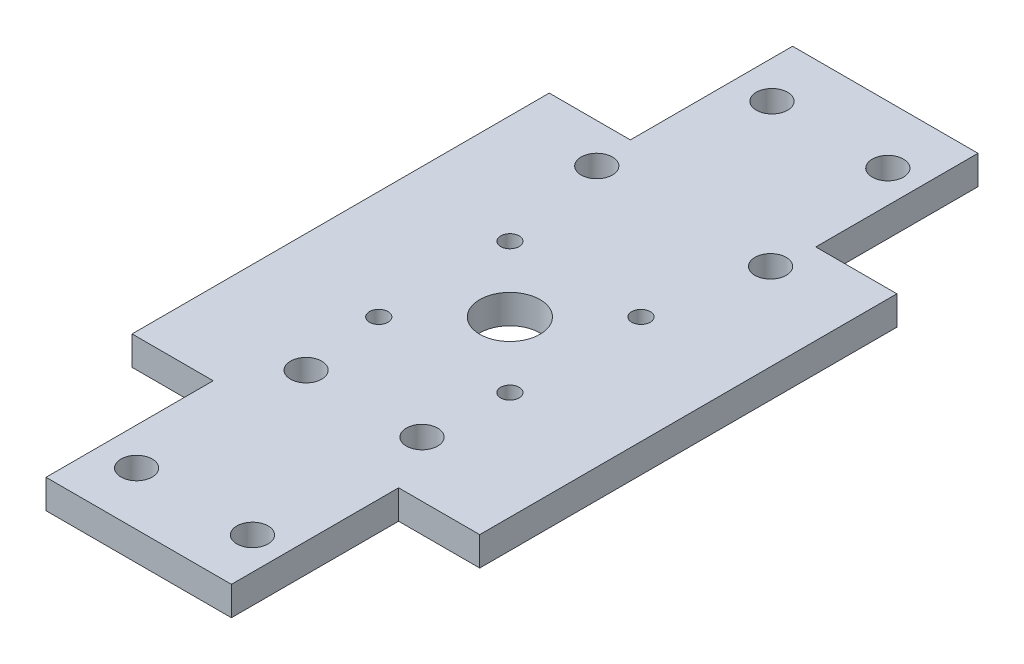
ISO-10303-21;
HEADER;
FILE_DESCRIPTION(('STEP AP214'),'2;1');
FILE_NAME('part.step','',(''),(''),'','','');
FILE_SCHEMA(('AUTOMOTIVE_DESIGN { 1 0 10303 214 1 1 1 1 }'));
ENDSEC;
DATA;
#1=APPLICATION_CONTEXT('core data for automotive mechanical design processes');
#2=APPLICATION_PROTOCOL_DEFINITION('international standard','automotive_design',2000,#1);
#3=PRODUCT_CONTEXT('',#1,'mechanical');
#4=PRODUCT('Part','Part','',(#3));
#5=PRODUCT_RELATED_PRODUCT_CATEGORY('part','',(#4));
#6=PRODUCT_DEFINITION_FORMATION('','',#4);
#7=PRODUCT_DEFINITION_CONTEXT('part definition',#1,'design');
#8=PRODUCT_DEFINITION('design','',#6,#7);
#9=PRODUCT_DEFINITION_SHAPE('','',#8);
#10=(LENGTH_UNIT() NAMED_UNIT(*) SI_UNIT(.MILLI.,.METRE.));
#11=(NAMED_UNIT(*) PLANE_ANGLE_UNIT() SI_UNIT($,.RADIAN.));
#12=(NAMED_UNIT(*) SI_UNIT($,.STERADIAN.) SOLID_ANGLE_UNIT());
#13=UNCERTAINTY_MEASURE_WITH_UNIT(LENGTH_MEASURE(1.E-05),#10,'distance_accuracy_value','');
#14=(GEOMETRIC_REPRESENTATION_CONTEXT(3) GLOBAL_UNCERTAINTY_ASSIGNED_CONTEXT((#13)) GLOBAL_UNIT_ASSIGNED_CONTEXT((#10,
#11,#12)) REPRESENTATION_CONTEXT('',''));
#15=CARTESIAN_POINT('',(0.,0.,0.));
#16=DIRECTION('',(0.,0.,1.));
#17=DIRECTION('',(1.,0.,0.));
#18=AXIS2_PLACEMENT_3D('',#15,#16,#17);
#19=CARTESIAN_POINT('',(-19.05,3.175,31.75));
#20=DIRECTION('',(0.,0.,-1.));
#21=DIRECTION('',(-1.,0.,0.));
#22=AXIS2_PLACEMENT_3D('',#19,#20,#21);
#23=PLANE('',#22);
#24=DIRECTION('',(0.,1.,0.));
#25=VECTOR('',#24,1.);
#26=CARTESIAN_POINT('',(10.16,0.,31.75));
#27=LINE('',#26,#25);
#28=CARTESIAN_POINT('',(10.16,0.,31.75));
#29=VERTEX_POINT('',#28);
#30=CARTESIAN_POINT('',(10.16,3.175,31.75));
#31=VERTEX_POINT('',#30);
#32=EDGE_CURVE('E305',#29,#31,#27,.T.);
#33=ORIENTED_EDGE('',*,*,#32,.F.);
#34=DIRECTION('',(1.,0.,0.));
#35=VECTOR('',#34,1.);
#36=CARTESIAN_POINT('',(-19.05,0.,31.75));
#37=LINE('',#36,#35);
#38=CARTESIAN_POINT('',(19.05,0.,31.75));
#39=VERTEX_POINT('',#38);
#40=EDGE_CURVE('E149',#29,#39,#37,.T.);
#41=ORIENTED_EDGE('',*,*,#40,.T.);
#42=DIRECTION('',(0.,-1.,0.));
#43=VECTOR('',#42,1.);
#44=CARTESIAN_POINT('',(19.05,3.175,31.75));
#45=LINE('',#44,#43);
#46=CARTESIAN_POINT('',(19.05,3.175,31.75));
#47=VERTEX_POINT('',#46);
#48=EDGE_CURVE('E42',#47,#39,#45,.T.);
#49=ORIENTED_EDGE('',*,*,#48,.F.);
#50=DIRECTION('',(1.,0.,0.));
#51=VECTOR('',#50,1.);
#52=CARTESIAN_POINT('',(-19.05,3.175,31.75));
#53=LINE('',#52,#51);
#54=EDGE_CURVE('E170',#31,#47,#53,.T.);
#55=ORIENTED_EDGE('',*,*,#54,.F.);
#56=EDGE_LOOP('',(#33,#41,#49,#55));
#57=FACE_BOUND('',#56,.T.);
#58=ADVANCED_FACE('F33',(#57),#23,.F.);
#59=CARTESIAN_POINT('',(19.05,3.175,31.75));
#60=DIRECTION('',(-1.,0.,0.));
#61=DIRECTION('',(0.,0.,1.));
#62=AXIS2_PLACEMENT_3D('',#59,#60,#61);
#63=PLANE('',#62);
#64=DIRECTION('',(0.,1.,0.));
#65=VECTOR('',#64,1.);
#66=CARTESIAN_POINT('',(19.05,0.,-13.97));
#67=LINE('',#66,#65);
#68=CARTESIAN_POINT('',(19.05,0.,-13.97));
#69=VERTEX_POINT('',#68);
#70=CARTESIAN_POINT('',(19.05,3.175,-13.97));
#71=VERTEX_POINT('',#70);
#72=EDGE_CURVE('E211',#69,#71,#67,.T.);
#73=ORIENTED_EDGE('',*,*,#72,.T.);
#74=DIRECTION('',(0.,0.,-1.));
#75=VECTOR('',#74,1.);
#76=CARTESIAN_POINT('',(19.05,3.175,31.75));
#77=LINE('',#76,#75);
#78=EDGE_CURVE('E148',#47,#71,#77,.T.);
#79=ORIENTED_EDGE('',*,*,#78,.F.);
#80=ORIENTED_EDGE('',*,*,#48,.T.);
#81=DIRECTION('',(0.,0.,-1.));
#82=VECTOR('',#81,1.);
#83=CARTESIAN_POINT('',(19.05,0.,31.75));
#84=LINE('',#83,#82);
#85=EDGE_CURVE('E180',#39,#69,#84,.T.);
#86=ORIENTED_EDGE('',*,*,#85,.T.);
#87=EDGE_LOOP('',(#73,#79,#80,#86));
#88=FACE_BOUND('',#87,.T.);
#89=ADVANCED_FACE('F35',(#88),#63,.F.);
#90=CARTESIAN_POINT('',(-19.05,3.175,-31.75));
#91=DIRECTION('',(0.,0.,1.));
#92=DIRECTION('',(1.,0.,0.));
#93=AXIS2_PLACEMENT_3D('',#90,#91,#92);
#94=PLANE('',#93);
#95=DIRECTION('',(0.,1.,0.));
#96=VECTOR('',#95,1.);
#97=CARTESIAN_POINT('',(10.16,0.,-31.75));
#98=LINE('',#97,#96);
#99=CARTESIAN_POINT('',(10.16,0.,-31.75));
#100=VERTEX_POINT('',#99);
#101=CARTESIAN_POINT('',(10.16,3.175,-31.75));
#102=VERTEX_POINT('',#101);
#103=EDGE_CURVE('E207',#100,#102,#98,.T.);
#104=ORIENTED_EDGE('',*,*,#103,.F.);
#105=DIRECTION('',(-1.,0.,0.));
#106=VECTOR('',#105,1.);
#107=CARTESIAN_POINT('',(-19.05,0.,-31.75));
#108=LINE('',#107,#106);
#109=CARTESIAN_POINT('',(-10.16,0.,-31.75));
#110=VERTEX_POINT('',#109);
#111=EDGE_CURVE('E182',#100,#110,#108,.T.);
#112=ORIENTED_EDGE('',*,*,#111,.T.);
#113=DIRECTION('',(0.,1.,0.));
#114=VECTOR('',#113,1.);
#115=CARTESIAN_POINT('',(-10.16,0.,-31.75));
#116=LINE('',#115,#114);
#117=CARTESIAN_POINT('',(-10.16,3.175,-31.75));
#118=VERTEX_POINT('',#117);
#119=EDGE_CURVE('E213',#110,#118,#116,.T.);
#120=ORIENTED_EDGE('',*,*,#119,.T.);
#121=DIRECTION('',(-1.,0.,0.));
#122=VECTOR('',#121,1.);
#123=CARTESIAN_POINT('',(-19.05,3.175,-31.75));
#124=LINE('',#123,#122);
#125=EDGE_CURVE('E152',#102,#118,#124,.T.);
#126=ORIENTED_EDGE('',*,*,#125,.F.);
#127=EDGE_LOOP('',(#104,#112,#120,#126));
#128=FACE_BOUND('',#127,.T.);
#129=ADVANCED_FACE('F292',(#128),#94,.F.);
#130=CARTESIAN_POINT('',(19.05,3.175,-31.75));
#131=DIRECTION('',(0.,-1.,0.));
#132=DIRECTION('',(0.,0.,-1.));
#133=AXIS2_PLACEMENT_3D('',#130,#131,#132);
#134=PLANE('',#133);
#135=CARTESIAN_POINT('',(0.0406851321502087,3.175,9.43357720583063));
#136=DIRECTION('',(0.,1.,0.));
#137=DIRECTION('',(0.,0.,1.));
#138=AXIS2_PLACEMENT_3D('',#135,#136,#137);
#139=CIRCLE('',#138,3.302);
#140=CARTESIAN_POINT('',(0.0406851321502087,3.175,12.7355772058306));
#141=VERTEX_POINT('',#140);
#142=EDGE_CURVE('E276',#141,#141,#139,.T.);
#143=ORIENTED_EDGE('',*,*,#142,.F.);
#144=EDGE_LOOP('',(#143));
#145=FACE_BOUND('',#144,.T.);
#146=CARTESIAN_POINT('',(7.22489002900553,3.175,16.617782102686));
#147=DIRECTION('',(0.,1.,0.));
#148=DIRECTION('',(0.,0.,1.));
#149=AXIS2_PLACEMENT_3D('',#146,#147,#148);
#150=CIRCLE('',#149,1.016);
#151=CARTESIAN_POINT('',(7.22489002900553,3.175,17.633782102686));
#152=VERTEX_POINT('',#151);
#153=EDGE_CURVE('E270',#152,#152,#150,.T.);
#154=ORIENTED_EDGE('',*,*,#153,.F.);
#155=EDGE_LOOP('',(#154));
#156=FACE_BOUND('',#155,.T.);
#157=CARTESIAN_POINT('',(-7.14351976470511,3.175,2.2493723089753));
#158=DIRECTION('',(0.,1.,0.));
#159=DIRECTION('',(0.,0.,1.));
#160=AXIS2_PLACEMENT_3D('',#157,#158,#159);
#161=CIRCLE('',#160,1.016);
#162=CARTESIAN_POINT('',(-7.14351976470511,3.175,3.2653723089753));
#163=VERTEX_POINT('',#162);
#164=EDGE_CURVE('E264',#163,#163,#161,.T.);
#165=ORIENTED_EDGE('',*,*,#164,.F.);
#166=EDGE_LOOP('',(#165));
#167=FACE_BOUND('',#166,.T.);
#168=CARTESIAN_POINT('',(-7.14351976470512,3.175,16.6177821026859));
#169=DIRECTION('',(0.,1.,0.));
#170=DIRECTION('',(0.,0.,1.));
#171=AXIS2_PLACEMENT_3D('',#168,#169,#170);
#172=CIRCLE('',#171,1.016);
#173=CARTESIAN_POINT('',(-7.14351976470512,3.175,17.6337821026859));
#174=VERTEX_POINT('',#173);
#175=EDGE_CURVE('E258',#174,#174,#172,.T.);
#176=ORIENTED_EDGE('',*,*,#175,.F.);
#177=EDGE_LOOP('',(#176));
#178=FACE_BOUND('',#177,.T.);
#179=CARTESIAN_POINT('',(7.22489002900554,3.175,2.2493723089753));
#180=DIRECTION('',(0.,1.,0.));
#181=DIRECTION('',(0.,0.,1.));
#182=AXIS2_PLACEMENT_3D('',#179,#180,#181);
#183=CIRCLE('',#182,1.016);
#184=CARTESIAN_POINT('',(7.22489002900554,3.175,3.2653723089753));
#185=VERTEX_POINT('',#184);
#186=EDGE_CURVE('E252',#185,#185,#183,.T.);
#187=ORIENTED_EDGE('',*,*,#186,.F.);
#188=EDGE_LOOP('',(#187));
#189=FACE_BOUND('',#188,.T.);
#190=CARTESIAN_POINT('',(-6.07182137832468,3.175,-25.4));
#191=DIRECTION('',(0.,1.,0.));
#192=DIRECTION('',(0.,0.,1.));
#193=AXIS2_PLACEMENT_3D('',#190,#191,#192);
#194=CIRCLE('',#193,1.7145);
#195=CARTESIAN_POINT('',(-6.07182137832468,3.175,-23.6855));
#196=VERTEX_POINT('',#195);
#197=EDGE_CURVE('E246',#196,#196,#194,.T.);
#198=ORIENTED_EDGE('',*,*,#197,.F.);
#199=EDGE_LOOP('',(#198));
#200=FACE_BOUND('',#199,.T.);
#201=CARTESIAN_POINT('',(6.62817862167532,3.175,-25.4));
#202=DIRECTION('',(0.,1.,0.));
#203=DIRECTION('',(0.,0.,1.));
#204=AXIS2_PLACEMENT_3D('',#201,#202,#203);
#205=CIRCLE('',#204,1.7145);
#206=CARTESIAN_POINT('',(6.62817862167532,3.175,-23.6855));
#207=VERTEX_POINT('',#206);
#208=EDGE_CURVE('E240',#207,#207,#205,.T.);
#209=ORIENTED_EDGE('',*,*,#208,.F.);
#210=EDGE_LOOP('',(#209));
#211=FACE_BOUND('',#210,.T.);
#212=CARTESIAN_POINT('',(6.62817862167533,3.175,25.654));
#213=DIRECTION('',(0.,1.,0.));
#214=DIRECTION('',(0.,0.,1.));
#215=AXIS2_PLACEMENT_3D('',#212,#213,#214);
#216=CIRCLE('',#215,1.7145);
#217=CARTESIAN_POINT('',(6.62817862167533,3.175,27.3685));
#218=VERTEX_POINT('',#217);
#219=EDGE_CURVE('E234',#218,#218,#216,.T.);
#220=ORIENTED_EDGE('',*,*,#219,.F.);
#221=EDGE_LOOP('',(#220));
#222=FACE_BOUND('',#221,.T.);
#223=CARTESIAN_POINT('',(-6.07182137832467,3.175,25.654));
#224=DIRECTION('',(0.,1.,0.));
#225=DIRECTION('',(0.,0.,1.));
#226=AXIS2_PLACEMENT_3D('',#223,#224,#225);
#227=CIRCLE('',#226,1.7145);
#228=CARTESIAN_POINT('',(-6.07182137832467,3.175,27.3685));
#229=VERTEX_POINT('',#228);
#230=EDGE_CURVE('E228',#229,#229,#227,.T.);
#231=ORIENTED_EDGE('',*,*,#230,.F.);
#232=EDGE_LOOP('',(#231));
#233=FACE_BOUND('',#232,.T.);
#234=CARTESIAN_POINT('',(9.525,3.175,-9.652));
#235=DIRECTION('',(0.,1.,0.));
#236=DIRECTION('',(0.,0.,1.));
#237=AXIS2_PLACEMENT_3D('',#234,#235,#236);
#238=CIRCLE('',#237,1.7145);
#239=CARTESIAN_POINT('',(9.525,3.175,-7.9375));
#240=VERTEX_POINT('',#239);
#241=EDGE_CURVE('E222',#240,#240,#238,.T.);
#242=ORIENTED_EDGE('',*,*,#241,.F.);
#243=EDGE_LOOP('',(#242));
#244=FACE_BOUND('',#243,.T.);
#245=CARTESIAN_POINT('',(-9.525,3.175,-9.652));
#246=DIRECTION('',(0.,1.,0.));
#247=DIRECTION('',(0.,0.,1.));
#248=AXIS2_PLACEMENT_3D('',#245,#246,#247);
#249=CIRCLE('',#248,1.7145);
#250=CARTESIAN_POINT('',(-9.525,3.175,-7.9375));
#251=VERTEX_POINT('',#250);
#252=EDGE_CURVE('E215',#251,#251,#249,.T.);
#253=ORIENTED_EDGE('',*,*,#252,.F.);
#254=EDGE_LOOP('',(#253));
#255=FACE_BOUND('',#254,.T.);
#256=DIRECTION('',(-1.,0.,0.));
#257=VECTOR('',#256,1.);
#258=CARTESIAN_POINT('',(10.16,3.175,-13.97));
#259=LINE('',#258,#257);
#260=CARTESIAN_POINT('',(10.16,3.175,-13.97));
#261=VERTEX_POINT('',#260);
#262=EDGE_CURVE('E296',#71,#261,#259,.T.);
#263=ORIENTED_EDGE('',*,*,#262,.T.);
#264=DIRECTION('',(0.,0.,-1.));
#265=VECTOR('',#264,1.);
#266=CARTESIAN_POINT('',(10.16,3.175,-31.75));
#267=LINE('',#266,#265);
#268=EDGE_CURVE('E299',#261,#102,#267,.T.);
#269=ORIENTED_EDGE('',*,*,#268,.T.);
#270=ORIENTED_EDGE('',*,*,#125,.T.);
#271=DIRECTION('',(0.,0.,-1.));
#272=VECTOR('',#271,1.);
#273=CARTESIAN_POINT('',(-10.16,3.175,-31.75));
#274=LINE('',#273,#272);
#275=CARTESIAN_POINT('',(-10.16,3.175,-13.97));
#276=VERTEX_POINT('',#275);
#277=EDGE_CURVE('E200',#276,#118,#274,.T.);
#278=ORIENTED_EDGE('',*,*,#277,.F.);
#279=DIRECTION('',(1.,0.,0.));
#280=VECTOR('',#279,1.);
#281=CARTESIAN_POINT('',(-10.16,3.175,-13.97));
#282=LINE('',#281,#280);
#283=CARTESIAN_POINT('',(-19.05,3.175,-13.97));
#284=VERTEX_POINT('',#283);
#285=EDGE_CURVE('E204',#284,#276,#282,.T.);
#286=ORIENTED_EDGE('',*,*,#285,.F.);
#287=DIRECTION('',(0.,0.,1.));
#288=VECTOR('',#287,1.);
#289=CARTESIAN_POINT('',(-19.05,3.175,31.75));
#290=LINE('',#289,#288);
#291=CARTESIAN_POINT('',(-19.05,3.175,31.75));
#292=VERTEX_POINT('',#291);
#293=EDGE_CURVE('E172',#284,#292,#290,.T.);
#294=ORIENTED_EDGE('',*,*,#293,.T.);
#295=CARTESIAN_POINT('',(-10.16,3.175,31.75));
#296=VERTEX_POINT('',#295);
#297=EDGE_CURVE('E164',#292,#296,#53,.T.);
#298=ORIENTED_EDGE('',*,*,#297,.T.);
#299=DIRECTION('',(0.,0.,1.));
#300=VECTOR('',#299,1.);
#301=CARTESIAN_POINT('',(-10.16,3.175,31.75));
#302=LINE('',#301,#300);
#303=CARTESIAN_POINT('',(-10.16,3.175,50.0735772058306));
#304=VERTEX_POINT('',#303);
#305=EDGE_CURVE('E50',#296,#304,#302,.T.);
#306=ORIENTED_EDGE('',*,*,#305,.T.);
#307=DIRECTION('',(1.,0.,0.));
#308=VECTOR('',#307,1.);
#309=CARTESIAN_POINT('',(-10.16,3.175,50.0735772058306));
#310=LINE('',#309,#308);
#311=CARTESIAN_POINT('',(10.16,3.175,50.0735772058306));
#312=VERTEX_POINT('',#311);
#313=EDGE_CURVE('E328',#304,#312,#310,.T.);
#314=ORIENTED_EDGE('',*,*,#313,.T.);
#315=DIRECTION('',(0.,0.,-1.));
#316=VECTOR('',#315,1.);
#317=CARTESIAN_POINT('',(10.16,3.175,50.0735772058306));
#318=LINE('',#317,#316);
#319=EDGE_CURVE('E144',#312,#31,#318,.T.);
#320=ORIENTED_EDGE('',*,*,#319,.T.);
#321=ORIENTED_EDGE('',*,*,#54,.T.);
#322=ORIENTED_EDGE('',*,*,#78,.T.);
#323=EDGE_LOOP('',(#263,#269,#270,#278,#286,#294,#298,#306,#314,#320,#321,#322));
#324=FACE_BOUND('',#323,.T.);
#325=CARTESIAN_POINT('',(6.62817862167533,3.175,44.2315772058306));
#326=DIRECTION('',(0.,1.,0.));
#327=DIRECTION('',(0.,0.,1.));
#328=AXIS2_PLACEMENT_3D('',#325,#326,#327);
#329=CIRCLE('',#328,1.7145);
#330=CARTESIAN_POINT('',(6.62817862167533,3.175,45.9460772058306));
#331=VERTEX_POINT('',#330);
#332=EDGE_CURVE('E346',#331,#331,#329,.T.);
#333=ORIENTED_EDGE('',*,*,#332,.F.);
#334=EDGE_LOOP('',(#333));
#335=FACE_BOUND('',#334,.T.);
#336=CARTESIAN_POINT('',(-6.07182137832467,3.175,44.2315772058306));
#337=DIRECTION('',(0.,1.,0.));
#338=DIRECTION('',(0.,0.,1.));
#339=AXIS2_PLACEMENT_3D('',#336,#337,#338);
#340=CIRCLE('',#339,1.7145);
#341=CARTESIAN_POINT('',(-6.07182137832467,3.175,45.9460772058306));
#342=VERTEX_POINT('',#341);
#343=EDGE_CURVE('E336',#342,#342,#340,.T.);
#344=ORIENTED_EDGE('',*,*,#343,.F.);
#345=EDGE_LOOP('',(#344));
#346=FACE_BOUND('',#345,.T.);
#347=ADVANCED_FACE('F287',(#145,#156,#167,#178,#189,#200,#211,#222,#233,#244,#255,#324,#335,
#346),#134,.F.);
#348=CARTESIAN_POINT('',(19.05,0.,-31.75));
#349=DIRECTION('',(0.,-1.,0.));
#350=DIRECTION('',(0.,0.,-1.));
#351=AXIS2_PLACEMENT_3D('',#348,#349,#350);
#352=PLANE('',#351);
#353=CARTESIAN_POINT('',(0.0406851321502087,0.,9.43357720583063));
#354=DIRECTION('',(0.,1.,0.));
#355=DIRECTION('',(0.,0.,1.));
#356=AXIS2_PLACEMENT_3D('',#353,#354,#355);
#357=CIRCLE('',#356,3.302);
#358=CARTESIAN_POINT('',(0.0406851321502087,0.,12.7355772058306));
#359=VERTEX_POINT('',#358);
#360=EDGE_CURVE('E183',#359,#359,#357,.T.);
#361=ORIENTED_EDGE('',*,*,#360,.T.);
#362=EDGE_LOOP('',(#361));
#363=FACE_BOUND('',#362,.T.);
#364=CARTESIAN_POINT('',(7.22489002900553,0.,16.617782102686));
#365=DIRECTION('',(0.,1.,0.));
#366=DIRECTION('',(0.,0.,1.));
#367=AXIS2_PLACEMENT_3D('',#364,#365,#366);
#368=CIRCLE('',#367,1.016);
#369=CARTESIAN_POINT('',(7.22489002900553,0.,17.633782102686));
#370=VERTEX_POINT('',#369);
#371=EDGE_CURVE('E273',#370,#370,#368,.T.);
#372=ORIENTED_EDGE('',*,*,#371,.T.);
#373=EDGE_LOOP('',(#372));
#374=FACE_BOUND('',#373,.T.);
#375=CARTESIAN_POINT('',(-7.14351976470511,0.,2.2493723089753));
#376=DIRECTION('',(0.,1.,0.));
#377=DIRECTION('',(0.,0.,1.));
#378=AXIS2_PLACEMENT_3D('',#375,#376,#377);
#379=CIRCLE('',#378,1.016);
#380=CARTESIAN_POINT('',(-7.14351976470511,0.,3.2653723089753));
#381=VERTEX_POINT('',#380);
#382=EDGE_CURVE('E267',#381,#381,#379,.T.);
#383=ORIENTED_EDGE('',*,*,#382,.T.);
#384=EDGE_LOOP('',(#383));
#385=FACE_BOUND('',#384,.T.);
#386=CARTESIAN_POINT('',(-7.14351976470512,0.,16.6177821026859));
#387=DIRECTION('',(0.,1.,0.));
#388=DIRECTION('',(0.,0.,1.));
#389=AXIS2_PLACEMENT_3D('',#386,#387,#388);
#390=CIRCLE('',#389,1.016);
#391=CARTESIAN_POINT('',(-7.14351976470512,0.,17.6337821026859));
#392=VERTEX_POINT('',#391);
#393=EDGE_CURVE('E261',#392,#392,#390,.T.);
#394=ORIENTED_EDGE('',*,*,#393,.T.);
#395=EDGE_LOOP('',(#394));
#396=FACE_BOUND('',#395,.T.);
#397=CARTESIAN_POINT('',(7.22489002900554,0.,2.2493723089753));
#398=DIRECTION('',(0.,1.,0.));
#399=DIRECTION('',(0.,0.,1.));
#400=AXIS2_PLACEMENT_3D('',#397,#398,#399);
#401=CIRCLE('',#400,1.016);
#402=CARTESIAN_POINT('',(7.22489002900554,0.,3.2653723089753));
#403=VERTEX_POINT('',#402);
#404=EDGE_CURVE('E255',#403,#403,#401,.T.);
#405=ORIENTED_EDGE('',*,*,#404,.T.);
#406=EDGE_LOOP('',(#405));
#407=FACE_BOUND('',#406,.T.);
#408=CARTESIAN_POINT('',(-6.07182137832468,0.,-25.4));
#409=DIRECTION('',(0.,1.,0.));
#410=DIRECTION('',(0.,0.,1.));
#411=AXIS2_PLACEMENT_3D('',#408,#409,#410);
#412=CIRCLE('',#411,1.7145);
#413=CARTESIAN_POINT('',(-6.07182137832468,0.,-23.6855));
#414=VERTEX_POINT('',#413);
#415=EDGE_CURVE('E249',#414,#414,#412,.T.);
#416=ORIENTED_EDGE('',*,*,#415,.T.);
#417=EDGE_LOOP('',(#416));
#418=FACE_BOUND('',#417,.T.);
#419=CARTESIAN_POINT('',(6.62817862167532,0.,-25.4));
#420=DIRECTION('',(0.,1.,0.));
#421=DIRECTION('',(0.,0.,1.));
#422=AXIS2_PLACEMENT_3D('',#419,#420,#421);
#423=CIRCLE('',#422,1.7145);
#424=CARTESIAN_POINT('',(6.62817862167532,0.,-23.6855));
#425=VERTEX_POINT('',#424);
#426=EDGE_CURVE('E243',#425,#425,#423,.T.);
#427=ORIENTED_EDGE('',*,*,#426,.T.);
#428=EDGE_LOOP('',(#427));
#429=FACE_BOUND('',#428,.T.);
#430=CARTESIAN_POINT('',(6.62817862167533,0.,25.654));
#431=DIRECTION('',(0.,1.,0.));
#432=DIRECTION('',(0.,0.,1.));
#433=AXIS2_PLACEMENT_3D('',#430,#431,#432);
#434=CIRCLE('',#433,1.7145);
#435=CARTESIAN_POINT('',(6.62817862167533,0.,27.3685));
#436=VERTEX_POINT('',#435);
#437=EDGE_CURVE('E237',#436,#436,#434,.T.);
#438=ORIENTED_EDGE('',*,*,#437,.T.);
#439=EDGE_LOOP('',(#438));
#440=FACE_BOUND('',#439,.T.);
#441=CARTESIAN_POINT('',(-6.07182137832467,0.,25.654));
#442=DIRECTION('',(0.,1.,0.));
#443=DIRECTION('',(0.,0.,1.));
#444=AXIS2_PLACEMENT_3D('',#441,#442,#443);
#445=CIRCLE('',#444,1.7145);
#446=CARTESIAN_POINT('',(-6.07182137832467,0.,27.3685));
#447=VERTEX_POINT('',#446);
#448=EDGE_CURVE('E231',#447,#447,#445,.T.);
#449=ORIENTED_EDGE('',*,*,#448,.T.);
#450=EDGE_LOOP('',(#449));
#451=FACE_BOUND('',#450,.T.);
#452=CARTESIAN_POINT('',(9.525,0.,-9.652));
#453=DIRECTION('',(0.,1.,0.));
#454=DIRECTION('',(0.,0.,1.));
#455=AXIS2_PLACEMENT_3D('',#452,#453,#454);
#456=CIRCLE('',#455,1.7145);
#457=CARTESIAN_POINT('',(9.525,0.,-7.9375));
#458=VERTEX_POINT('',#457);
#459=EDGE_CURVE('E225',#458,#458,#456,.T.);
#460=ORIENTED_EDGE('',*,*,#459,.T.);
#461=EDGE_LOOP('',(#460));
#462=FACE_BOUND('',#461,.T.);
#463=CARTESIAN_POINT('',(-9.525,0.,-9.652));
#464=DIRECTION('',(0.,1.,0.));
#465=DIRECTION('',(0.,0.,1.));
#466=AXIS2_PLACEMENT_3D('',#463,#464,#465);
#467=CIRCLE('',#466,1.7145);
#468=CARTESIAN_POINT('',(-9.525,0.,-7.9375));
#469=VERTEX_POINT('',#468);
#470=EDGE_CURVE('E219',#469,#469,#467,.T.);
#471=ORIENTED_EDGE('',*,*,#470,.T.);
#472=EDGE_LOOP('',(#471));
#473=FACE_BOUND('',#472,.T.);
#474=DIRECTION('',(0.,0.,-1.));
#475=VECTOR('',#474,1.);
#476=CARTESIAN_POINT('',(10.16,0.,-31.75));
#477=LINE('',#476,#475);
#478=CARTESIAN_POINT('',(10.16,0.,-13.97));
#479=VERTEX_POINT('',#478);
#480=EDGE_CURVE('E295',#479,#100,#477,.T.);
#481=ORIENTED_EDGE('',*,*,#480,.F.);
#482=DIRECTION('',(-1.,0.,0.));
#483=VECTOR('',#482,1.);
#484=CARTESIAN_POINT('',(10.16,0.,-13.97));
#485=LINE('',#484,#483);
#486=EDGE_CURVE('E293',#69,#479,#485,.T.);
#487=ORIENTED_EDGE('',*,*,#486,.F.);
#488=ORIENTED_EDGE('',*,*,#85,.F.);
#489=ORIENTED_EDGE('',*,*,#40,.F.);
#490=DIRECTION('',(0.,0.,-1.));
#491=VECTOR('',#490,1.);
#492=CARTESIAN_POINT('',(10.16,0.,50.0735772058306));
#493=LINE('',#492,#491);
#494=CARTESIAN_POINT('',(10.16,0.,50.0735772058306));
#495=VERTEX_POINT('',#494);
#496=EDGE_CURVE('E131',#495,#29,#493,.T.);
#497=ORIENTED_EDGE('',*,*,#496,.F.);
#498=DIRECTION('',(1.,0.,0.));
#499=VECTOR('',#498,1.);
#500=CARTESIAN_POINT('',(-10.16,0.,50.0735772058306));
#501=LINE('',#500,#499);
#502=CARTESIAN_POINT('',(-10.16,0.,50.0735772058306));
#503=VERTEX_POINT('',#502);
#504=EDGE_CURVE('E143',#503,#495,#501,.T.);
#505=ORIENTED_EDGE('',*,*,#504,.F.);
#506=DIRECTION('',(0.,0.,1.));
#507=VECTOR('',#506,1.);
#508=CARTESIAN_POINT('',(-10.16,0.,31.75));
#509=LINE('',#508,#507);
#510=CARTESIAN_POINT('',(-10.16,0.,31.75));
#511=VERTEX_POINT('',#510);
#512=EDGE_CURVE('E125',#511,#503,#509,.T.);
#513=ORIENTED_EDGE('',*,*,#512,.F.);
#514=CARTESIAN_POINT('',(-19.05,0.,31.75));
#515=VERTEX_POINT('',#514);
#516=EDGE_CURVE('E140',#515,#511,#37,.T.);
#517=ORIENTED_EDGE('',*,*,#516,.F.);
#518=DIRECTION('',(0.,0.,1.));
#519=VECTOR('',#518,1.);
#520=CARTESIAN_POINT('',(-19.05,0.,31.75));
#521=LINE('',#520,#519);
#522=CARTESIAN_POINT('',(-19.05,0.,-13.97));
#523=VERTEX_POINT('',#522);
#524=EDGE_CURVE('E154',#523,#515,#521,.T.);
#525=ORIENTED_EDGE('',*,*,#524,.F.);
#526=DIRECTION('',(1.,0.,0.));
#527=VECTOR('',#526,1.);
#528=CARTESIAN_POINT('',(-10.16,0.,-13.97));
#529=LINE('',#528,#527);
#530=CARTESIAN_POINT('',(-10.16,0.,-13.97));
#531=VERTEX_POINT('',#530);
#532=EDGE_CURVE('E196',#523,#531,#529,.T.);
#533=ORIENTED_EDGE('',*,*,#532,.T.);
#534=DIRECTION('',(0.,0.,-1.));
#535=VECTOR('',#534,1.);
#536=CARTESIAN_POINT('',(-10.16,0.,-31.75));
#537=LINE('',#536,#535);
#538=EDGE_CURVE('E197',#531,#110,#537,.T.);
#539=ORIENTED_EDGE('',*,*,#538,.T.);
#540=ORIENTED_EDGE('',*,*,#111,.F.);
#541=EDGE_LOOP('',(#481,#487,#488,#489,#497,#505,#513,#517,#525,#533,#539,#540));
#542=FACE_BOUND('',#541,.T.);
#543=CARTESIAN_POINT('',(6.62817862167533,0.,44.2315772058306));
#544=DIRECTION('',(0.,1.,0.));
#545=DIRECTION('',(0.,0.,1.));
#546=AXIS2_PLACEMENT_3D('',#543,#544,#545);
#547=CIRCLE('',#546,1.7145);
#548=CARTESIAN_POINT('',(6.62817862167533,0.,45.9460772058306));
#549=VERTEX_POINT('',#548);
#550=EDGE_CURVE('E343',#549,#549,#547,.T.);
#551=ORIENTED_EDGE('',*,*,#550,.T.);
#552=EDGE_LOOP('',(#551));
#553=FACE_BOUND('',#552,.T.);
#554=CARTESIAN_POINT('',(-6.07182137832467,0.,44.2315772058306));
#555=DIRECTION('',(0.,1.,0.));
#556=DIRECTION('',(0.,0.,1.));
#557=AXIS2_PLACEMENT_3D('',#554,#555,#556);
#558=CIRCLE('',#557,1.7145);
#559=CARTESIAN_POINT('',(-6.07182137832467,0.,45.9460772058306));
#560=VERTEX_POINT('',#559);
#561=EDGE_CURVE('E334',#560,#560,#558,.T.);
#562=ORIENTED_EDGE('',*,*,#561,.T.);
#563=EDGE_LOOP('',(#562));
#564=FACE_BOUND('',#563,.T.);
#565=ADVANCED_FACE('F137',(#363,#374,#385,#396,#407,#418,#429,#440,#451,#462,#473,#542,#553,
#564),#352,.T.);
#566=CARTESIAN_POINT('',(-19.05,3.175,31.75));
#567=DIRECTION('',(1.,0.,0.));
#568=DIRECTION('',(0.,0.,-1.));
#569=AXIS2_PLACEMENT_3D('',#566,#567,#568);
#570=PLANE('',#569);
#571=ORIENTED_EDGE('',*,*,#293,.F.);
#572=DIRECTION('',(0.,1.,0.));
#573=VECTOR('',#572,1.);
#574=CARTESIAN_POINT('',(-19.05,0.,-13.97));
#575=LINE('',#574,#573);
#576=EDGE_CURVE('E193',#523,#284,#575,.T.);
#577=ORIENTED_EDGE('',*,*,#576,.F.);
#578=ORIENTED_EDGE('',*,*,#524,.T.);
#579=DIRECTION('',(0.,-1.,0.));
#580=VECTOR('',#579,1.);
#581=CARTESIAN_POINT('',(-19.05,3.175,31.75));
#582=LINE('',#581,#580);
#583=EDGE_CURVE('E11',#292,#515,#582,.T.);
#584=ORIENTED_EDGE('',*,*,#583,.F.);
#585=EDGE_LOOP('',(#571,#577,#578,#584));
#586=FACE_BOUND('',#585,.T.);
#587=ADVANCED_FACE('F192',(#586),#570,.F.);
#588=ORIENTED_EDGE('',*,*,#516,.T.);
#589=DIRECTION('',(0.,1.,0.));
#590=VECTOR('',#589,1.);
#591=CARTESIAN_POINT('',(-10.16,0.,31.75));
#592=LINE('',#591,#590);
#593=EDGE_CURVE('E122',#511,#296,#592,.T.);
#594=ORIENTED_EDGE('',*,*,#593,.T.);
#595=ORIENTED_EDGE('',*,*,#297,.F.);
#596=ORIENTED_EDGE('',*,*,#583,.T.);
#597=EDGE_LOOP('',(#588,#594,#595,#596));
#598=FACE_BOUND('',#597,.T.);
#599=ADVANCED_FACE('F146',(#598),#23,.F.);
#600=CARTESIAN_POINT('',(0.0406851321502087,0.,9.43357720583063));
#601=DIRECTION('',(0.,1.,0.));
#602=DIRECTION('',(0.,0.,1.));
#603=AXIS2_PLACEMENT_3D('',#600,#601,#602);
#604=CYLINDRICAL_SURFACE('',#603,3.302);
#605=ORIENTED_EDGE('',*,*,#360,.F.);
#606=EDGE_LOOP('',(#605));
#607=FACE_BOUND('',#606,.T.);
#608=ORIENTED_EDGE('',*,*,#142,.T.);
#609=EDGE_LOOP('',(#608));
#610=FACE_BOUND('',#609,.T.);
#611=ADVANCED_FACE('F369',(#607,#610),#604,.F.);
#612=CARTESIAN_POINT('',(7.22489002900553,0.,16.617782102686));
#613=DIRECTION('',(0.,1.,0.));
#614=DIRECTION('',(0.,0.,1.));
#615=AXIS2_PLACEMENT_3D('',#612,#613,#614);
#616=CYLINDRICAL_SURFACE('',#615,1.016);
#617=ORIENTED_EDGE('',*,*,#371,.F.);
#618=EDGE_LOOP('',(#617));
#619=FACE_BOUND('',#618,.T.);
#620=ORIENTED_EDGE('',*,*,#153,.T.);
#621=EDGE_LOOP('',(#620));
#622=FACE_BOUND('',#621,.T.);
#623=ADVANCED_FACE('F374',(#619,#622),#616,.F.);
#624=CARTESIAN_POINT('',(-7.14351976470511,0.,2.2493723089753));
#625=DIRECTION('',(0.,1.,0.));
#626=DIRECTION('',(0.,0.,1.));
#627=AXIS2_PLACEMENT_3D('',#624,#625,#626);
#628=CYLINDRICAL_SURFACE('',#627,1.016);
#629=ORIENTED_EDGE('',*,*,#382,.F.);
#630=EDGE_LOOP('',(#629));
#631=FACE_BOUND('',#630,.T.);
#632=ORIENTED_EDGE('',*,*,#164,.T.);
#633=EDGE_LOOP('',(#632));
#634=FACE_BOUND('',#633,.T.);
#635=ADVANCED_FACE('F397',(#631,#634),#628,.F.);
#636=CARTESIAN_POINT('',(-7.14351976470512,0.,16.6177821026859));
#637=DIRECTION('',(0.,1.,0.));
#638=DIRECTION('',(0.,0.,1.));
#639=AXIS2_PLACEMENT_3D('',#636,#637,#638);
#640=CYLINDRICAL_SURFACE('',#639,1.016);
#641=ORIENTED_EDGE('',*,*,#393,.F.);
#642=EDGE_LOOP('',(#641));
#643=FACE_BOUND('',#642,.T.);
#644=ORIENTED_EDGE('',*,*,#175,.T.);
#645=EDGE_LOOP('',(#644));
#646=FACE_BOUND('',#645,.T.);
#647=ADVANCED_FACE('F401',(#643,#646),#640,.F.);
#648=CARTESIAN_POINT('',(7.22489002900554,0.,2.2493723089753));
#649=DIRECTION('',(0.,1.,0.));
#650=DIRECTION('',(0.,0.,1.));
#651=AXIS2_PLACEMENT_3D('',#648,#649,#650);
#652=CYLINDRICAL_SURFACE('',#651,1.016);
#653=ORIENTED_EDGE('',*,*,#404,.F.);
#654=EDGE_LOOP('',(#653));
#655=FACE_BOUND('',#654,.T.);
#656=ORIENTED_EDGE('',*,*,#186,.T.);
#657=EDGE_LOOP('',(#656));
#658=FACE_BOUND('',#657,.T.);
#659=ADVANCED_FACE('F405',(#655,#658),#652,.F.);
#660=CARTESIAN_POINT('',(-6.07182137832468,0.,-25.4));
#661=DIRECTION('',(0.,1.,0.));
#662=DIRECTION('',(0.,0.,1.));
#663=AXIS2_PLACEMENT_3D('',#660,#661,#662);
#664=CYLINDRICAL_SURFACE('',#663,1.7145);
#665=ORIENTED_EDGE('',*,*,#415,.F.);
#666=EDGE_LOOP('',(#665));
#667=FACE_BOUND('',#666,.T.);
#668=ORIENTED_EDGE('',*,*,#197,.T.);
#669=EDGE_LOOP('',(#668));
#670=FACE_BOUND('',#669,.T.);
#671=ADVANCED_FACE('F409',(#667,#670),#664,.F.);
#672=CARTESIAN_POINT('',(6.62817862167532,0.,-25.4));
#673=DIRECTION('',(0.,1.,0.));
#674=DIRECTION('',(0.,0.,1.));
#675=AXIS2_PLACEMENT_3D('',#672,#673,#674);
#676=CYLINDRICAL_SURFACE('',#675,1.7145);
#677=ORIENTED_EDGE('',*,*,#426,.F.);
#678=EDGE_LOOP('',(#677));
#679=FACE_BOUND('',#678,.T.);
#680=ORIENTED_EDGE('',*,*,#208,.T.);
#681=EDGE_LOOP('',(#680));
#682=FACE_BOUND('',#681,.T.);
#683=ADVANCED_FACE('F413',(#679,#682),#676,.F.);
#684=CARTESIAN_POINT('',(6.62817862167533,0.,25.654));
#685=DIRECTION('',(0.,1.,0.));
#686=DIRECTION('',(0.,0.,1.));
#687=AXIS2_PLACEMENT_3D('',#684,#685,#686);
#688=CYLINDRICAL_SURFACE('',#687,1.7145);
#689=ORIENTED_EDGE('',*,*,#437,.F.);
#690=EDGE_LOOP('',(#689));
#691=FACE_BOUND('',#690,.T.);
#692=ORIENTED_EDGE('',*,*,#219,.T.);
#693=EDGE_LOOP('',(#692));
#694=FACE_BOUND('',#693,.T.);
#695=ADVANCED_FACE('F417',(#691,#694),#688,.F.);
#696=CARTESIAN_POINT('',(-6.07182137832467,0.,25.654));
#697=DIRECTION('',(0.,1.,0.));
#698=DIRECTION('',(0.,0.,1.));
#699=AXIS2_PLACEMENT_3D('',#696,#697,#698);
#700=CYLINDRICAL_SURFACE('',#699,1.7145);
#701=ORIENTED_EDGE('',*,*,#448,.F.);
#702=EDGE_LOOP('',(#701));
#703=FACE_BOUND('',#702,.T.);
#704=ORIENTED_EDGE('',*,*,#230,.T.);
#705=EDGE_LOOP('',(#704));
#706=FACE_BOUND('',#705,.T.);
#707=ADVANCED_FACE('F421',(#703,#706),#700,.F.);
#708=CARTESIAN_POINT('',(9.525,0.,-9.652));
#709=DIRECTION('',(0.,1.,0.));
#710=DIRECTION('',(0.,0.,1.));
#711=AXIS2_PLACEMENT_3D('',#708,#709,#710);
#712=CYLINDRICAL_SURFACE('',#711,1.7145);
#713=ORIENTED_EDGE('',*,*,#459,.F.);
#714=EDGE_LOOP('',(#713));
#715=FACE_BOUND('',#714,.T.);
#716=ORIENTED_EDGE('',*,*,#241,.T.);
#717=EDGE_LOOP('',(#716));
#718=FACE_BOUND('',#717,.T.);
#719=ADVANCED_FACE('F425',(#715,#718),#712,.F.);
#720=CARTESIAN_POINT('',(-9.525,0.,-9.652));
#721=DIRECTION('',(0.,1.,0.));
#722=DIRECTION('',(0.,0.,1.));
#723=AXIS2_PLACEMENT_3D('',#720,#721,#722);
#724=CYLINDRICAL_SURFACE('',#723,1.7145);
#725=ORIENTED_EDGE('',*,*,#470,.F.);
#726=EDGE_LOOP('',(#725));
#727=FACE_BOUND('',#726,.T.);
#728=ORIENTED_EDGE('',*,*,#252,.T.);
#729=EDGE_LOOP('',(#728));
#730=FACE_BOUND('',#729,.T.);
#731=ADVANCED_FACE('F429',(#727,#730),#724,.F.);
#732=CARTESIAN_POINT('',(-10.16,0.,-31.75));
#733=DIRECTION('',(1.,0.,0.));
#734=DIRECTION('',(0.,0.,-1.));
#735=AXIS2_PLACEMENT_3D('',#732,#733,#734);
#736=PLANE('',#735);
#737=ORIENTED_EDGE('',*,*,#277,.T.);
#738=ORIENTED_EDGE('',*,*,#119,.F.);
#739=ORIENTED_EDGE('',*,*,#538,.F.);
#740=DIRECTION('',(0.,1.,0.));
#741=VECTOR('',#740,1.);
#742=CARTESIAN_POINT('',(-10.16,0.,-13.97));
#743=LINE('',#742,#741);
#744=EDGE_CURVE('E216',#531,#276,#743,.T.);
#745=ORIENTED_EDGE('',*,*,#744,.T.);
#746=EDGE_LOOP('',(#737,#738,#739,#745));
#747=FACE_BOUND('',#746,.T.);
#748=ADVANCED_FACE('F291',(#747),#736,.F.);
#749=CARTESIAN_POINT('',(-10.16,0.,-13.97));
#750=DIRECTION('',(0.,0.,1.));
#751=DIRECTION('',(1.,0.,0.));
#752=AXIS2_PLACEMENT_3D('',#749,#750,#751);
#753=PLANE('',#752);
#754=ORIENTED_EDGE('',*,*,#285,.T.);
#755=ORIENTED_EDGE('',*,*,#744,.F.);
#756=ORIENTED_EDGE('',*,*,#532,.F.);
#757=ORIENTED_EDGE('',*,*,#576,.T.);
#758=EDGE_LOOP('',(#754,#755,#756,#757));
#759=FACE_BOUND('',#758,.T.);
#760=ADVANCED_FACE('F289',(#759),#753,.F.);
#761=CARTESIAN_POINT('',(10.16,0.,-13.97));
#762=DIRECTION('',(0.,0.,-1.));
#763=DIRECTION('',(-1.,0.,0.));
#764=AXIS2_PLACEMENT_3D('',#761,#762,#763);
#765=PLANE('',#764);
#766=ORIENTED_EDGE('',*,*,#262,.F.);
#767=ORIENTED_EDGE('',*,*,#72,.F.);
#768=ORIENTED_EDGE('',*,*,#486,.T.);
#769=DIRECTION('',(0.,1.,0.));
#770=VECTOR('',#769,1.);
#771=CARTESIAN_POINT('',(10.16,0.,-13.97));
#772=LINE('',#771,#770);
#773=EDGE_CURVE('E58',#479,#261,#772,.T.);
#774=ORIENTED_EDGE('',*,*,#773,.T.);
#775=EDGE_LOOP('',(#766,#767,#768,#774));
#776=FACE_BOUND('',#775,.T.);
#777=ADVANCED_FACE('F309',(#776),#765,.T.);
#778=CARTESIAN_POINT('',(10.16,0.,-31.75));
#779=DIRECTION('',(1.,0.,0.));
#780=DIRECTION('',(0.,0.,-1.));
#781=AXIS2_PLACEMENT_3D('',#778,#779,#780);
#782=PLANE('',#781);
#783=ORIENTED_EDGE('',*,*,#268,.F.);
#784=ORIENTED_EDGE('',*,*,#773,.F.);
#785=ORIENTED_EDGE('',*,*,#480,.T.);
#786=ORIENTED_EDGE('',*,*,#103,.T.);
#787=EDGE_LOOP('',(#783,#784,#785,#786));
#788=FACE_BOUND('',#787,.T.);
#789=ADVANCED_FACE('F310',(#788),#782,.T.);
#790=CARTESIAN_POINT('',(10.16,0.,50.0735772058306));
#791=DIRECTION('',(1.,0.,0.));
#792=DIRECTION('',(0.,0.,-1.));
#793=AXIS2_PLACEMENT_3D('',#790,#791,#792);
#794=PLANE('',#793);
#795=ORIENTED_EDGE('',*,*,#319,.F.);
#796=DIRECTION('',(0.,1.,0.));
#797=VECTOR('',#796,1.);
#798=CARTESIAN_POINT('',(10.16,0.,50.0735772058306));
#799=LINE('',#798,#797);
#800=EDGE_CURVE('E318',#495,#312,#799,.T.);
#801=ORIENTED_EDGE('',*,*,#800,.F.);
#802=ORIENTED_EDGE('',*,*,#496,.T.);
#803=ORIENTED_EDGE('',*,*,#32,.T.);
#804=EDGE_LOOP('',(#795,#801,#802,#803));
#805=FACE_BOUND('',#804,.T.);
#806=ADVANCED_FACE('F348',(#805),#794,.T.);
#807=CARTESIAN_POINT('',(-10.16,0.,50.0735772058306));
#808=DIRECTION('',(0.,0.,1.));
#809=DIRECTION('',(1.,0.,0.));
#810=AXIS2_PLACEMENT_3D('',#807,#808,#809);
#811=PLANE('',#810);
#812=ORIENTED_EDGE('',*,*,#313,.F.);
#813=DIRECTION('',(0.,1.,0.));
#814=VECTOR('',#813,1.);
#815=CARTESIAN_POINT('',(-10.16,0.,50.0735772058306));
#816=LINE('',#815,#814);
#817=EDGE_CURVE('E130',#503,#304,#816,.T.);
#818=ORIENTED_EDGE('',*,*,#817,.F.);
#819=ORIENTED_EDGE('',*,*,#504,.T.);
#820=ORIENTED_EDGE('',*,*,#800,.T.);
#821=EDGE_LOOP('',(#812,#818,#819,#820));
#822=FACE_BOUND('',#821,.T.);
#823=ADVANCED_FACE('F333',(#822),#811,.T.);
#824=CARTESIAN_POINT('',(-10.16,0.,31.75));
#825=DIRECTION('',(-1.,0.,0.));
#826=DIRECTION('',(0.,0.,1.));
#827=AXIS2_PLACEMENT_3D('',#824,#825,#826);
#828=PLANE('',#827);
#829=ORIENTED_EDGE('',*,*,#305,.F.);
#830=ORIENTED_EDGE('',*,*,#593,.F.);
#831=ORIENTED_EDGE('',*,*,#512,.T.);
#832=ORIENTED_EDGE('',*,*,#817,.T.);
#833=EDGE_LOOP('',(#829,#830,#831,#832));
#834=FACE_BOUND('',#833,.T.);
#835=ADVANCED_FACE('F124',(#834),#828,.T.);
#836=CARTESIAN_POINT('',(-6.07182137832467,0.,44.2315772058306));
#837=DIRECTION('',(0.,1.,0.));
#838=DIRECTION('',(0.,0.,1.));
#839=AXIS2_PLACEMENT_3D('',#836,#837,#838);
#840=CYLINDRICAL_SURFACE('',#839,1.7145);
#841=ORIENTED_EDGE('',*,*,#561,.F.);
#842=EDGE_LOOP('',(#841));
#843=FACE_BOUND('',#842,.T.);
#844=ORIENTED_EDGE('',*,*,#343,.T.);
#845=EDGE_LOOP('',(#844));
#846=FACE_BOUND('',#845,.T.);
#847=ADVANCED_FACE('F441',(#843,#846),#840,.F.);
#848=CARTESIAN_POINT('',(6.62817862167533,0.,44.2315772058306));
#849=DIRECTION('',(0.,1.,0.));
#850=DIRECTION('',(0.,0.,1.));
#851=AXIS2_PLACEMENT_3D('',#848,#849,#850);
#852=CYLINDRICAL_SURFACE('',#851,1.7145);
#853=ORIENTED_EDGE('',*,*,#550,.F.);
#854=EDGE_LOOP('',(#853));
#855=FACE_BOUND('',#854,.T.);
#856=ORIENTED_EDGE('',*,*,#332,.T.);
#857=EDGE_LOOP('',(#856));
#858=FACE_BOUND('',#857,.T.);
#859=ADVANCED_FACE('F445',(#855,#858),#852,.F.);
#860=CLOSED_SHELL('',(#58,#89,#129,#347,#565,#587,#599,#611,#623,#635,#647,#659,#671,#683,#695,
#707,#719,#731,#748,#760,#777,#789,#806,#823,#835,#847,#859));
#861=MANIFOLD_SOLID_BREP('B2',#860);
#862=ADVANCED_BREP_SHAPE_REPRESENTATION('',(#18,#861),#14);
#863=SHAPE_DEFINITION_REPRESENTATION(#9,#862);
ENDSEC;
END-ISO-10303-21;
